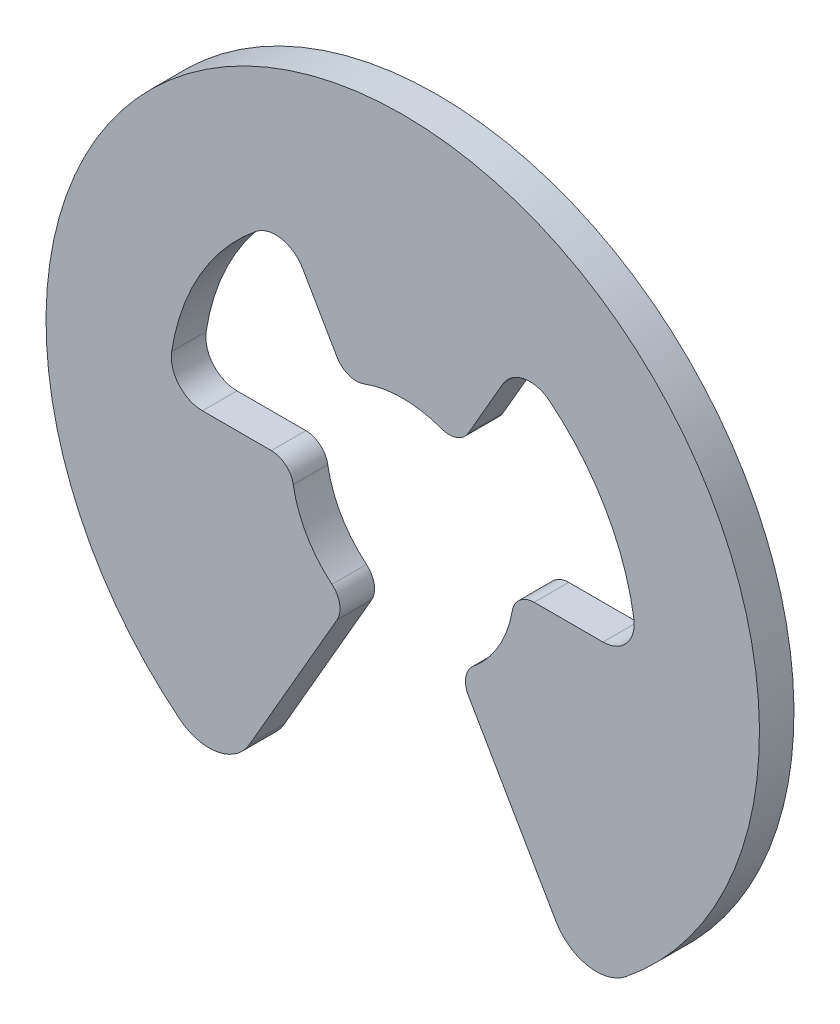
ISO-10303-21;
HEADER;
FILE_DESCRIPTION(('STEP AP214'),'2;1');
FILE_NAME('part.step','',(''),(''),'','','');
FILE_SCHEMA(('AUTOMOTIVE_DESIGN { 1 0 10303 214 1 1 1 1 }'));
ENDSEC;
DATA;
#1=APPLICATION_CONTEXT('core data for automotive mechanical design processes');
#2=APPLICATION_PROTOCOL_DEFINITION('international standard','automotive_design',2000,#1);
#3=PRODUCT_CONTEXT('',#1,'mechanical');
#4=PRODUCT('Part','Part','',(#3));
#5=PRODUCT_RELATED_PRODUCT_CATEGORY('part','',(#4));
#6=PRODUCT_DEFINITION_FORMATION('','',#4);
#7=PRODUCT_DEFINITION_CONTEXT('part definition',#1,'design');
#8=PRODUCT_DEFINITION('design','',#6,#7);
#9=PRODUCT_DEFINITION_SHAPE('','',#8);
#10=(LENGTH_UNIT() NAMED_UNIT(*) SI_UNIT(.MILLI.,.METRE.));
#11=(NAMED_UNIT(*) PLANE_ANGLE_UNIT() SI_UNIT($,.RADIAN.));
#12=(NAMED_UNIT(*) SI_UNIT($,.STERADIAN.) SOLID_ANGLE_UNIT());
#13=UNCERTAINTY_MEASURE_WITH_UNIT(LENGTH_MEASURE(1.E-05),#10,'distance_accuracy_value','');
#14=(GEOMETRIC_REPRESENTATION_CONTEXT(3) GLOBAL_UNCERTAINTY_ASSIGNED_CONTEXT((#13)) GLOBAL_UNIT_ASSIGNED_CONTEXT((#10,
#11,#12)) REPRESENTATION_CONTEXT('',''));
#15=CARTESIAN_POINT('',(0.,0.,0.));
#16=DIRECTION('',(0.,0.,1.));
#17=DIRECTION('',(1.,0.,0.));
#18=AXIS2_PLACEMENT_3D('',#15,#16,#17);
#19=CARTESIAN_POINT('',(2.13787209593711,-2.67039309024686,0.1905));
#20=DIRECTION('',(0.,0.,-1.));
#21=DIRECTION('',(-1.,0.,0.));
#22=AXIS2_PLACEMENT_3D('',#19,#20,#21);
#23=CYLINDRICAL_SURFACE('',#22,0.516254999999999);
#24=DIRECTION('',(0.,0.,-1.));
#25=VECTOR('',#24,1.);
#26=CARTESIAN_POINT('',(1.6907821511064,-2.9285205902469,0.1905));
#27=LINE('',#26,#25);
#28=CARTESIAN_POINT('',(1.6907821511064,-2.9285205902469,0.1905));
#29=VERTEX_POINT('',#28);
#30=CARTESIAN_POINT('',(1.6907821511064,-2.9285205902469,-0.1905));
#31=VERTEX_POINT('',#30);
#32=EDGE_CURVE('E213',#29,#31,#27,.T.);
#33=ORIENTED_EDGE('',*,*,#32,.T.);
#34=CARTESIAN_POINT('',(2.13787209593711,-2.67039309024686,-0.1905));
#35=DIRECTION('',(0.,0.,1.));
#36=DIRECTION('',(1.,0.,0.));
#37=AXIS2_PLACEMENT_3D('',#34,#35,#36);
#38=CIRCLE('',#37,0.516254999999999);
#39=CARTESIAN_POINT('',(2.4605173556358,-3.0734058213348,-0.1905));
#40=VERTEX_POINT('',#39);
#41=EDGE_CURVE('E207',#31,#40,#38,.T.);
#42=ORIENTED_EDGE('',*,*,#41,.T.);
#43=DIRECTION('',(0.,0.,-1.));
#44=VECTOR('',#43,1.);
#45=CARTESIAN_POINT('',(2.4605173556358,-3.0734058213348,0.1905));
#46=LINE('',#45,#44);
#47=CARTESIAN_POINT('',(2.4605173556358,-3.0734058213348,0.1905));
#48=VERTEX_POINT('',#47);
#49=EDGE_CURVE('E11',#48,#40,#46,.T.);
#50=ORIENTED_EDGE('',*,*,#49,.F.);
#51=CARTESIAN_POINT('',(2.13787209593711,-2.67039309024686,0.1905));
#52=DIRECTION('',(0.,0.,1.));
#53=DIRECTION('',(1.,0.,0.));
#54=AXIS2_PLACEMENT_3D('',#51,#52,#53);
#55=CIRCLE('',#54,0.516254999999999);
#56=EDGE_CURVE('E279',#29,#48,#55,.T.);
#57=ORIENTED_EDGE('',*,*,#56,.F.);
#58=EDGE_LOOP('',(#33,#42,#50,#57));
#59=FACE_BOUND('',#58,.T.);
#60=ADVANCED_FACE('F35',(#59),#23,.T.);
#61=CARTESIAN_POINT('',(0.,0.,0.1905));
#62=DIRECTION('',(0.,0.,-1.));
#63=DIRECTION('',(-1.,0.,0.));
#64=AXIS2_PLACEMENT_3D('',#61,#62,#63);
#65=CYLINDRICAL_SURFACE('',#64,3.93699999999997);
#66=ORIENTED_EDGE('',*,*,#49,.T.);
#67=CARTESIAN_POINT('',(0.,0.,-0.1905));
#68=DIRECTION('',(0.,0.,1.));
#69=DIRECTION('',(1.,0.,0.));
#70=AXIS2_PLACEMENT_3D('',#67,#68,#69);
#71=CIRCLE('',#70,3.93699999999997);
#72=CARTESIAN_POINT('',(-2.4605173556358,-3.0734058213348,-0.1905));
#73=VERTEX_POINT('',#72);
#74=EDGE_CURVE('E197',#40,#73,#71,.T.);
#75=ORIENTED_EDGE('',*,*,#74,.T.);
#76=DIRECTION('',(0.,0.,-1.));
#77=VECTOR('',#76,1.);
#78=CARTESIAN_POINT('',(-2.4605173556358,-3.0734058213348,0.1905));
#79=LINE('',#78,#77);
#80=CARTESIAN_POINT('',(-2.4605173556358,-3.0734058213348,0.1905));
#81=VERTEX_POINT('',#80);
#82=EDGE_CURVE('E42',#81,#73,#79,.T.);
#83=ORIENTED_EDGE('',*,*,#82,.F.);
#84=CARTESIAN_POINT('',(0.,0.,0.1905));
#85=DIRECTION('',(0.,0.,1.));
#86=DIRECTION('',(1.,0.,0.));
#87=AXIS2_PLACEMENT_3D('',#84,#85,#86);
#88=CIRCLE('',#87,3.93699999999997);
#89=EDGE_CURVE('E198',#48,#81,#88,.T.);
#90=ORIENTED_EDGE('',*,*,#89,.F.);
#91=EDGE_LOOP('',(#66,#75,#83,#90));
#92=FACE_BOUND('',#91,.T.);
#93=ADVANCED_FACE('F195',(#92),#65,.T.);
#94=CARTESIAN_POINT('',(-2.13787209593711,-2.67039309024686,0.1905));
#95=DIRECTION('',(0.,0.,-1.));
#96=DIRECTION('',(-1.,0.,0.));
#97=AXIS2_PLACEMENT_3D('',#94,#95,#96);
#98=CYLINDRICAL_SURFACE('',#97,0.516254999999999);
#99=ORIENTED_EDGE('',*,*,#82,.T.);
#100=CARTESIAN_POINT('',(-2.13787209593711,-2.67039309024686,-0.1905));
#101=DIRECTION('',(0.,0.,1.));
#102=DIRECTION('',(1.,0.,0.));
#103=AXIS2_PLACEMENT_3D('',#100,#101,#102);
#104=CIRCLE('',#103,0.516254999999999);
#105=CARTESIAN_POINT('',(-1.6907821511064,-2.9285205902469,-0.1905));
#106=VERTEX_POINT('',#105);
#107=EDGE_CURVE('E211',#73,#106,#104,.T.);
#108=ORIENTED_EDGE('',*,*,#107,.T.);
#109=DIRECTION('',(0.,0.,-1.));
#110=VECTOR('',#109,1.);
#111=CARTESIAN_POINT('',(-1.6907821511064,-2.9285205902469,0.1905));
#112=LINE('',#111,#110);
#113=CARTESIAN_POINT('',(-1.6907821511064,-2.9285205902469,0.1905));
#114=VERTEX_POINT('',#113);
#115=EDGE_CURVE('E365',#114,#106,#112,.T.);
#116=ORIENTED_EDGE('',*,*,#115,.F.);
#117=CARTESIAN_POINT('',(-2.13787209593711,-2.67039309024686,0.1905));
#118=DIRECTION('',(0.,0.,1.));
#119=DIRECTION('',(1.,0.,0.));
#120=AXIS2_PLACEMENT_3D('',#117,#118,#119);
#121=CIRCLE('',#120,0.516254999999999);
#122=EDGE_CURVE('E282',#81,#114,#121,.T.);
#123=ORIENTED_EDGE('',*,*,#122,.F.);
#124=EDGE_LOOP('',(#99,#108,#116,#123));
#125=FACE_BOUND('',#124,.T.);
#126=ADVANCED_FACE('F368',(#125),#98,.T.);
#127=CARTESIAN_POINT('',(-1.6907821511064,-2.9285205902469,0.1905));
#128=DIRECTION('',(-0.866025403784437,0.500000000000002,0.));
#129=DIRECTION('',(-0.500000000000002,-0.866025403784437,0.));
#130=AXIS2_PLACEMENT_3D('',#127,#128,#129);
#131=PLANE('',#130);
#132=ORIENTED_EDGE('',*,*,#115,.T.);
#133=DIRECTION('',(0.500000000000002,0.866025403784437,0.));
#134=VECTOR('',#133,1.);
#135=CARTESIAN_POINT('',(-1.6907821511064,-2.9285205902469,-0.1905));
#136=LINE('',#135,#134);
#137=CARTESIAN_POINT('',(-0.72504515781777,-1.2558150511222,-0.1905));
#138=VERTEX_POINT('',#137);
#139=EDGE_CURVE('E217',#106,#138,#136,.T.);
#140=ORIENTED_EDGE('',*,*,#139,.T.);
#141=DIRECTION('',(0.,0.,-1.));
#142=VECTOR('',#141,1.);
#143=CARTESIAN_POINT('',(-0.72504515781777,-1.2558150511222,0.1905));
#144=LINE('',#143,#142);
#145=CARTESIAN_POINT('',(-0.72504515781777,-1.2558150511222,0.1905));
#146=VERTEX_POINT('',#145);
#147=EDGE_CURVE('E363',#146,#138,#144,.T.);
#148=ORIENTED_EDGE('',*,*,#147,.F.);
#149=DIRECTION('',(0.500000000000002,0.866025403784437,0.));
#150=VECTOR('',#149,1.);
#151=CARTESIAN_POINT('',(-1.6907821511064,-2.9285205902469,0.1905));
#152=LINE('',#151,#150);
#153=EDGE_CURVE('E284',#114,#146,#152,.T.);
#154=ORIENTED_EDGE('',*,*,#153,.F.);
#155=EDGE_LOOP('',(#132,#140,#148,#154));
#156=FACE_BOUND('',#155,.T.);
#157=ADVANCED_FACE('F376',(#156),#131,.F.);
#158=CARTESIAN_POINT('',(-0.937316644539424,-1.1332600511222,0.1905));
#159=DIRECTION('',(0.,0.,-1.));
#160=DIRECTION('',(-1.,0.,0.));
#161=AXIS2_PLACEMENT_3D('',#158,#159,#160);
#162=CYLINDRICAL_SURFACE('',#161,0.245110000000045);
#163=ORIENTED_EDGE('',*,*,#147,.T.);
#164=CARTESIAN_POINT('',(-0.937316644539424,-1.1332600511222,-0.1905));
#165=DIRECTION('',(0.,0.,1.));
#166=DIRECTION('',(1.,0.,0.));
#167=AXIS2_PLACEMENT_3D('',#164,#165,#166);
#168=CIRCLE('',#167,0.245110000000045);
#169=CARTESIAN_POINT('',(-0.78109720378281,-0.94438337593515,-0.1905));
#170=VERTEX_POINT('',#169);
#171=EDGE_CURVE('E220',#138,#170,#168,.T.);
#172=ORIENTED_EDGE('',*,*,#171,.T.);
#173=DIRECTION('',(0.,0.,-1.));
#174=VECTOR('',#173,1.);
#175=CARTESIAN_POINT('',(-0.78109720378281,-0.94438337593515,0.1905));
#176=LINE('',#175,#174);
#177=CARTESIAN_POINT('',(-0.78109720378281,-0.94438337593515,0.1905));
#178=VERTEX_POINT('',#177);
#179=EDGE_CURVE('E361',#178,#170,#176,.T.);
#180=ORIENTED_EDGE('',*,*,#179,.F.);
#181=CARTESIAN_POINT('',(-0.937316644539424,-1.1332600511222,0.1905));
#182=DIRECTION('',(0.,0.,1.));
#183=DIRECTION('',(1.,0.,0.));
#184=AXIS2_PLACEMENT_3D('',#181,#182,#183);
#185=CIRCLE('',#184,0.245110000000045);
#186=EDGE_CURVE('E286',#146,#178,#185,.T.);
#187=ORIENTED_EDGE('',*,*,#186,.F.);
#188=EDGE_LOOP('',(#163,#172,#180,#187));
#189=FACE_BOUND('',#188,.T.);
#190=ADVANCED_FACE('F379',(#189),#162,.T.);
#191=CARTESIAN_POINT('',(0.,0.,0.1905));
#192=DIRECTION('',(0.,0.,-1.));
#193=DIRECTION('',(-1.,0.,0.));
#194=AXIS2_PLACEMENT_3D('',#191,#192,#193);
#195=CYLINDRICAL_SURFACE('',#194,1.22555000000003);
#196=ORIENTED_EDGE('',*,*,#179,.T.);
#197=CARTESIAN_POINT('',(0.,0.,-0.1905));
#198=DIRECTION('',(0.,0.,-1.));
#199=DIRECTION('',(-1.,0.,0.));
#200=AXIS2_PLACEMENT_3D('',#197,#198,#199);
#201=CIRCLE('',#200,1.22555000000003);
#202=CARTESIAN_POINT('',(-1.20840859636299,-0.204258333333328,-0.1905));
#203=VERTEX_POINT('',#202);
#204=EDGE_CURVE('E223',#170,#203,#201,.T.);
#205=ORIENTED_EDGE('',*,*,#204,.T.);
#206=DIRECTION('',(0.,0.,-1.));
#207=VECTOR('',#206,1.);
#208=CARTESIAN_POINT('',(-1.20840859636299,-0.204258333333328,0.1905));
#209=LINE('',#208,#207);
#210=CARTESIAN_POINT('',(-1.20840859636299,-0.204258333333328,0.1905));
#211=VERTEX_POINT('',#210);
#212=EDGE_CURVE('E359',#211,#203,#209,.T.);
#213=ORIENTED_EDGE('',*,*,#212,.F.);
#214=CARTESIAN_POINT('',(0.,0.,0.1905));
#215=DIRECTION('',(0.,0.,-1.));
#216=DIRECTION('',(-1.,0.,0.));
#217=AXIS2_PLACEMENT_3D('',#214,#215,#216);
#218=CIRCLE('',#217,1.22555000000003);
#219=EDGE_CURVE('E288',#178,#211,#218,.T.);
#220=ORIENTED_EDGE('',*,*,#219,.F.);
#221=EDGE_LOOP('',(#196,#205,#213,#220));
#222=FACE_BOUND('',#221,.T.);
#223=ADVANCED_FACE('F384',(#222),#195,.F.);
#224=CARTESIAN_POINT('',(-1.45009031563546,-0.245109999999846,0.1905));
#225=DIRECTION('',(0.,0.,-1.));
#226=DIRECTION('',(-1.,0.,0.));
#227=AXIS2_PLACEMENT_3D('',#224,#225,#226);
#228=CYLINDRICAL_SURFACE('',#227,0.245109999999846);
#229=ORIENTED_EDGE('',*,*,#212,.T.);
#230=CARTESIAN_POINT('',(-1.45009031563546,-0.245109999999846,-0.1905));
#231=DIRECTION('',(0.,0.,1.));
#232=DIRECTION('',(1.,0.,0.));
#233=AXIS2_PLACEMENT_3D('',#230,#231,#232);
#234=CIRCLE('',#233,0.245109999999846);
#235=CARTESIAN_POINT('',(-1.4500903156355,0.,-0.1905));
#236=VERTEX_POINT('',#235);
#237=EDGE_CURVE('E226',#203,#236,#234,.T.);
#238=ORIENTED_EDGE('',*,*,#237,.T.);
#239=DIRECTION('',(0.,0.,-1.));
#240=VECTOR('',#239,1.);
#241=CARTESIAN_POINT('',(-1.4500903156355,0.,0.1905));
#242=LINE('',#241,#240);
#243=CARTESIAN_POINT('',(-1.4500903156355,0.,0.1905));
#244=VERTEX_POINT('',#243);
#245=EDGE_CURVE('E357',#244,#236,#242,.T.);
#246=ORIENTED_EDGE('',*,*,#245,.F.);
#247=CARTESIAN_POINT('',(-1.45009031563546,-0.245109999999846,0.1905));
#248=DIRECTION('',(0.,0.,1.));
#249=DIRECTION('',(1.,0.,0.));
#250=AXIS2_PLACEMENT_3D('',#247,#248,#249);
#251=CIRCLE('',#250,0.245109999999846);
#252=EDGE_CURVE('E290',#211,#244,#251,.T.);
#253=ORIENTED_EDGE('',*,*,#252,.F.);
#254=EDGE_LOOP('',(#229,#238,#246,#253));
#255=FACE_BOUND('',#254,.T.);
#256=ADVANCED_FACE('F390',(#255),#228,.T.);
#257=CARTESIAN_POINT('',(-1.4500903156355,0.,0.1905));
#258=DIRECTION('',(0.,-1.,0.));
#259=DIRECTION('',(0.,0.,-1.));
#260=AXIS2_PLACEMENT_3D('',#257,#258,#259);
#261=PLANE('',#260);
#262=ORIENTED_EDGE('',*,*,#245,.T.);
#263=DIRECTION('',(-1.,0.,0.));
#264=VECTOR('',#263,1.);
#265=CARTESIAN_POINT('',(-1.4500903156355,0.,-0.1905));
#266=LINE('',#265,#264);
#267=CARTESIAN_POINT('',(-2.2104718482996,0.,-0.1905));
#268=VERTEX_POINT('',#267);
#269=EDGE_CURVE('E229',#236,#268,#266,.T.);
#270=ORIENTED_EDGE('',*,*,#269,.T.);
#271=DIRECTION('',(0.,0.,-1.));
#272=VECTOR('',#271,1.);
#273=CARTESIAN_POINT('',(-2.2104718482996,0.,0.1905));
#274=LINE('',#273,#272);
#275=CARTESIAN_POINT('',(-2.2104718482996,0.,0.1905));
#276=VERTEX_POINT('',#275);
#277=EDGE_CURVE('E355',#276,#268,#274,.T.);
#278=ORIENTED_EDGE('',*,*,#277,.F.);
#279=DIRECTION('',(-1.,0.,0.));
#280=VECTOR('',#279,1.);
#281=CARTESIAN_POINT('',(-1.4500903156355,0.,0.1905));
#282=LINE('',#281,#280);
#283=EDGE_CURVE('E292',#244,#276,#282,.T.);
#284=ORIENTED_EDGE('',*,*,#283,.F.);
#285=EDGE_LOOP('',(#262,#270,#278,#284));
#286=FACE_BOUND('',#285,.T.);
#287=ADVANCED_FACE('F394',(#286),#261,.F.);
#288=CARTESIAN_POINT('',(-2.21047184829961,0.344169999999997,0.1905));
#289=DIRECTION('',(0.,0.,-1.));
#290=DIRECTION('',(-1.,0.,0.));
#291=AXIS2_PLACEMENT_3D('',#288,#289,#290);
#292=CYLINDRICAL_SURFACE('',#291,0.344169999999997);
#293=ORIENTED_EDGE('',*,*,#277,.T.);
#294=CARTESIAN_POINT('',(-2.21047184829961,0.344169999999997,-0.1905));
#295=DIRECTION('',(0.,0.,-1.));
#296=DIRECTION('',(-1.,0.,0.));
#297=AXIS2_PLACEMENT_3D('',#294,#295,#296);
#298=CIRCLE('',#297,0.344169999999997);
#299=CARTESIAN_POINT('',(-2.5505444403457,0.39711923076923,-0.1905));
#300=VERTEX_POINT('',#299);
#301=EDGE_CURVE('E232',#268,#300,#298,.T.);
#302=ORIENTED_EDGE('',*,*,#301,.T.);
#303=DIRECTION('',(0.,0.,-1.));
#304=VECTOR('',#303,1.);
#305=CARTESIAN_POINT('',(-2.5505444403457,0.39711923076923,0.1905));
#306=LINE('',#305,#304);
#307=CARTESIAN_POINT('',(-2.5505444403457,0.39711923076923,0.1905));
#308=VERTEX_POINT('',#307);
#309=EDGE_CURVE('E353',#308,#300,#306,.T.);
#310=ORIENTED_EDGE('',*,*,#309,.F.);
#311=CARTESIAN_POINT('',(-2.21047184829961,0.344169999999997,0.1905));
#312=DIRECTION('',(0.,0.,-1.));
#313=DIRECTION('',(-1.,0.,0.));
#314=AXIS2_PLACEMENT_3D('',#311,#312,#313);
#315=CIRCLE('',#314,0.344169999999997);
#316=EDGE_CURVE('E294',#276,#308,#315,.T.);
#317=ORIENTED_EDGE('',*,*,#316,.F.);
#318=EDGE_LOOP('',(#293,#302,#310,#317));
#319=FACE_BOUND('',#318,.T.);
#320=ADVANCED_FACE('F399',(#319),#292,.F.);
#321=CARTESIAN_POINT('',(0.,0.,0.1905));
#322=DIRECTION('',(0.,0.,-1.));
#323=DIRECTION('',(-1.,0.,0.));
#324=AXIS2_PLACEMENT_3D('',#321,#322,#323);
#325=CYLINDRICAL_SURFACE('',#324,2.581275);
#326=ORIENTED_EDGE('',*,*,#309,.T.);
#327=CARTESIAN_POINT('',(0.,0.,-0.1905));
#328=DIRECTION('',(0.,0.,-1.));
#329=DIRECTION('',(-1.,0.,0.));
#330=AXIS2_PLACEMENT_3D('',#327,#328,#329);
#331=CIRCLE('',#330,2.581275);
#332=CARTESIAN_POINT('',(-1.61918752550471,2.01027669311342,-0.1905));
#333=VERTEX_POINT('',#332);
#334=EDGE_CURVE('E235',#300,#333,#331,.T.);
#335=ORIENTED_EDGE('',*,*,#334,.T.);
#336=DIRECTION('',(0.,0.,-1.));
#337=VECTOR('',#336,1.);
#338=CARTESIAN_POINT('',(-1.61918752550471,2.01027669311342,0.1905));
#339=LINE('',#338,#337);
#340=CARTESIAN_POINT('',(-1.61918752550471,2.01027669311342,0.1905));
#341=VERTEX_POINT('',#340);
#342=EDGE_CURVE('E351',#341,#333,#339,.T.);
#343=ORIENTED_EDGE('',*,*,#342,.F.);
#344=CARTESIAN_POINT('',(0.,0.,0.1905));
#345=DIRECTION('',(0.,0.,-1.));
#346=DIRECTION('',(-1.,0.,0.));
#347=AXIS2_PLACEMENT_3D('',#344,#345,#346);
#348=CIRCLE('',#347,2.581275);
#349=EDGE_CURVE('E296',#308,#341,#348,.T.);
#350=ORIENTED_EDGE('',*,*,#349,.F.);
#351=EDGE_LOOP('',(#326,#335,#343,#350));
#352=FACE_BOUND('',#351,.T.);
#353=ADVANCED_FACE('F405',(#352),#325,.F.);
#354=CARTESIAN_POINT('',(-1.4032958873703,1.74223977497771,0.1905));
#355=DIRECTION('',(0.,0.,-1.));
#356=DIRECTION('',(-1.,0.,0.));
#357=AXIS2_PLACEMENT_3D('',#354,#355,#356);
#358=CYLINDRICAL_SURFACE('',#357,0.344170000000049);
#359=ORIENTED_EDGE('',*,*,#342,.T.);
#360=CARTESIAN_POINT('',(-1.4032958873703,1.74223977497771,-0.1905));
#361=DIRECTION('',(0.,0.,-1.));
#362=DIRECTION('',(-1.,0.,0.));
#363=AXIS2_PLACEMENT_3D('',#360,#361,#362);
#364=CIRCLE('',#363,0.344170000000049);
#365=CARTESIAN_POINT('',(-1.1052359241498,1.9143247749778,-0.1905));
#366=VERTEX_POINT('',#365);
#367=EDGE_CURVE('E238',#333,#366,#364,.T.);
#368=ORIENTED_EDGE('',*,*,#367,.T.);
#369=DIRECTION('',(0.,0.,-1.));
#370=VECTOR('',#369,1.);
#371=CARTESIAN_POINT('',(-1.1052359241498,1.9143247749778,0.1905));
#372=LINE('',#371,#370);
#373=CARTESIAN_POINT('',(-1.1052359241498,1.9143247749778,0.1905));
#374=VERTEX_POINT('',#373);
#375=EDGE_CURVE('E349',#374,#366,#372,.T.);
#376=ORIENTED_EDGE('',*,*,#375,.F.);
#377=CARTESIAN_POINT('',(-1.4032958873703,1.74223977497771,0.1905));
#378=DIRECTION('',(0.,0.,-1.));
#379=DIRECTION('',(-1.,0.,0.));
#380=AXIS2_PLACEMENT_3D('',#377,#378,#379);
#381=CIRCLE('',#380,0.344170000000049);
#382=EDGE_CURVE('E298',#341,#374,#381,.T.);
#383=ORIENTED_EDGE('',*,*,#382,.F.);
#384=EDGE_LOOP('',(#359,#368,#376,#383));
#385=FACE_BOUND('',#384,.T.);
#386=ADVANCED_FACE('F409',(#385),#358,.F.);
#387=CARTESIAN_POINT('',(-1.1052359241498,1.9143247749778,0.1905));
#388=DIRECTION('',(0.866025403784431,0.500000000000013,0.));
#389=DIRECTION('',(-0.500000000000013,0.866025403784431,0.));
#390=AXIS2_PLACEMENT_3D('',#387,#388,#389);
#391=PLANE('',#390);
#392=ORIENTED_EDGE('',*,*,#375,.T.);
#393=DIRECTION('',(0.500000000000013,-0.866025403784431,0.));
#394=VECTOR('',#393,1.);
#395=CARTESIAN_POINT('',(-1.1052359241498,1.9143247749778,-0.1905));
#396=LINE('',#395,#394);
#397=CARTESIAN_POINT('',(-0.72504515781777,1.2558150511222,-0.1905));
#398=VERTEX_POINT('',#397);
#399=EDGE_CURVE('E241',#366,#398,#396,.T.);
#400=ORIENTED_EDGE('',*,*,#399,.T.);
#401=DIRECTION('',(0.,0.,-1.));
#402=VECTOR('',#401,1.);
#403=CARTESIAN_POINT('',(-0.72504515781777,1.2558150511222,0.1905));
#404=LINE('',#403,#402);
#405=CARTESIAN_POINT('',(-0.72504515781777,1.2558150511222,0.1905));
#406=VERTEX_POINT('',#405);
#407=EDGE_CURVE('E347',#406,#398,#404,.T.);
#408=ORIENTED_EDGE('',*,*,#407,.F.);
#409=DIRECTION('',(0.500000000000013,-0.866025403784431,0.));
#410=VECTOR('',#409,1.);
#411=CARTESIAN_POINT('',(-1.1052359241498,1.9143247749778,0.1905));
#412=LINE('',#411,#410);
#413=EDGE_CURVE('E300',#374,#406,#412,.T.);
#414=ORIENTED_EDGE('',*,*,#413,.F.);
#415=EDGE_LOOP('',(#392,#400,#408,#414));
#416=FACE_BOUND('',#415,.T.);
#417=ADVANCED_FACE('F414',(#416),#391,.F.);
#418=CARTESIAN_POINT('',(-0.512773671096169,1.37837005112219,0.1905));
#419=DIRECTION('',(0.,0.,-1.));
#420=DIRECTION('',(-1.,0.,0.));
#421=AXIS2_PLACEMENT_3D('',#418,#419,#420);
#422=CYLINDRICAL_SURFACE('',#421,0.24510999999999);
#423=ORIENTED_EDGE('',*,*,#407,.T.);
#424=CARTESIAN_POINT('',(-0.512773671096169,1.37837005112219,-0.1905));
#425=DIRECTION('',(0.,0.,1.));
#426=DIRECTION('',(1.,0.,0.));
#427=AXIS2_PLACEMENT_3D('',#424,#425,#426);
#428=CIRCLE('',#427,0.24510999999999);
#429=CARTESIAN_POINT('',(-0.42731139258014,1.1486417092685,-0.1905));
#430=VERTEX_POINT('',#429);
#431=EDGE_CURVE('E244',#398,#430,#428,.T.);
#432=ORIENTED_EDGE('',*,*,#431,.T.);
#433=DIRECTION('',(0.,0.,-1.));
#434=VECTOR('',#433,1.);
#435=CARTESIAN_POINT('',(-0.42731139258014,1.1486417092685,0.1905));
#436=LINE('',#435,#434);
#437=CARTESIAN_POINT('',(-0.42731139258014,1.1486417092685,0.1905));
#438=VERTEX_POINT('',#437);
#439=EDGE_CURVE('E345',#438,#430,#436,.T.);
#440=ORIENTED_EDGE('',*,*,#439,.F.);
#441=CARTESIAN_POINT('',(-0.512773671096169,1.37837005112219,0.1905));
#442=DIRECTION('',(0.,0.,1.));
#443=DIRECTION('',(1.,0.,0.));
#444=AXIS2_PLACEMENT_3D('',#441,#442,#443);
#445=CIRCLE('',#444,0.24510999999999);
#446=EDGE_CURVE('E302',#406,#438,#445,.T.);
#447=ORIENTED_EDGE('',*,*,#446,.F.);
#448=EDGE_LOOP('',(#423,#432,#440,#447));
#449=FACE_BOUND('',#448,.T.);
#450=ADVANCED_FACE('F420',(#449),#422,.T.);
#451=CARTESIAN_POINT('',(0.,0.,0.1905));
#452=DIRECTION('',(0.,0.,-1.));
#453=DIRECTION('',(-1.,0.,0.));
#454=AXIS2_PLACEMENT_3D('',#451,#452,#453);
#455=CYLINDRICAL_SURFACE('',#454,1.22554999999999);
#456=ORIENTED_EDGE('',*,*,#439,.T.);
#457=CARTESIAN_POINT('',(0.,0.,-0.1905));
#458=DIRECTION('',(0.,0.,-1.));
#459=DIRECTION('',(-1.,0.,0.));
#460=AXIS2_PLACEMENT_3D('',#457,#458,#459);
#461=CIRCLE('',#460,1.22554999999999);
#462=CARTESIAN_POINT('',(0.42731139258014,1.1486417092685,-0.1905));
#463=VERTEX_POINT('',#462);
#464=EDGE_CURVE('E247',#430,#463,#461,.T.);
#465=ORIENTED_EDGE('',*,*,#464,.T.);
#466=DIRECTION('',(0.,0.,-1.));
#467=VECTOR('',#466,1.);
#468=CARTESIAN_POINT('',(0.42731139258014,1.1486417092685,0.1905));
#469=LINE('',#468,#467);
#470=CARTESIAN_POINT('',(0.42731139258014,1.1486417092685,0.1905));
#471=VERTEX_POINT('',#470);
#472=EDGE_CURVE('E343',#471,#463,#469,.T.);
#473=ORIENTED_EDGE('',*,*,#472,.F.);
#474=CARTESIAN_POINT('',(0.,0.,0.1905));
#475=DIRECTION('',(0.,0.,-1.));
#476=DIRECTION('',(-1.,0.,0.));
#477=AXIS2_PLACEMENT_3D('',#474,#475,#476);
#478=CIRCLE('',#477,1.22554999999999);
#479=EDGE_CURVE('E304',#438,#471,#478,.T.);
#480=ORIENTED_EDGE('',*,*,#479,.F.);
#481=EDGE_LOOP('',(#456,#465,#473,#480));
#482=FACE_BOUND('',#481,.T.);
#483=ADVANCED_FACE('F424',(#482),#455,.F.);
#484=CARTESIAN_POINT('',(0.512773671096169,1.37837005112219,0.1905));
#485=DIRECTION('',(0.,0.,-1.));
#486=DIRECTION('',(-1.,0.,0.));
#487=AXIS2_PLACEMENT_3D('',#484,#485,#486);
#488=CYLINDRICAL_SURFACE('',#487,0.24510999999999);
#489=ORIENTED_EDGE('',*,*,#472,.T.);
#490=CARTESIAN_POINT('',(0.512773671096169,1.37837005112219,-0.1905));
#491=DIRECTION('',(0.,0.,1.));
#492=DIRECTION('',(1.,0.,0.));
#493=AXIS2_PLACEMENT_3D('',#490,#491,#492);
#494=CIRCLE('',#493,0.24510999999999);
#495=CARTESIAN_POINT('',(0.72504515781777,1.2558150511222,-0.1905));
#496=VERTEX_POINT('',#495);
#497=EDGE_CURVE('E250',#463,#496,#494,.T.);
#498=ORIENTED_EDGE('',*,*,#497,.T.);
#499=DIRECTION('',(0.,0.,-1.));
#500=VECTOR('',#499,1.);
#501=CARTESIAN_POINT('',(0.72504515781777,1.2558150511222,0.1905));
#502=LINE('',#501,#500);
#503=CARTESIAN_POINT('',(0.72504515781777,1.2558150511222,0.1905));
#504=VERTEX_POINT('',#503);
#505=EDGE_CURVE('E341',#504,#496,#502,.T.);
#506=ORIENTED_EDGE('',*,*,#505,.F.);
#507=CARTESIAN_POINT('',(0.512773671096169,1.37837005112219,0.1905));
#508=DIRECTION('',(0.,0.,1.));
#509=DIRECTION('',(1.,0.,0.));
#510=AXIS2_PLACEMENT_3D('',#507,#508,#509);
#511=CIRCLE('',#510,0.24510999999999);
#512=EDGE_CURVE('E306',#471,#504,#511,.T.);
#513=ORIENTED_EDGE('',*,*,#512,.F.);
#514=EDGE_LOOP('',(#489,#498,#506,#513));
#515=FACE_BOUND('',#514,.T.);
#516=ADVANCED_FACE('F429',(#515),#488,.T.);
#517=CARTESIAN_POINT('',(0.72504515781777,1.2558150511222,0.1905));
#518=DIRECTION('',(-0.866025403784431,0.500000000000013,0.));
#519=DIRECTION('',(-0.500000000000013,-0.866025403784431,0.));
#520=AXIS2_PLACEMENT_3D('',#517,#518,#519);
#521=PLANE('',#520);
#522=ORIENTED_EDGE('',*,*,#505,.T.);
#523=DIRECTION('',(0.500000000000013,0.866025403784431,0.));
#524=VECTOR('',#523,1.);
#525=CARTESIAN_POINT('',(0.72504515781777,1.2558150511222,-0.1905));
#526=LINE('',#525,#524);
#527=CARTESIAN_POINT('',(1.1052359241498,1.9143247749778,-0.1905));
#528=VERTEX_POINT('',#527);
#529=EDGE_CURVE('E253',#496,#528,#526,.T.);
#530=ORIENTED_EDGE('',*,*,#529,.T.);
#531=DIRECTION('',(0.,0.,-1.));
#532=VECTOR('',#531,1.);
#533=CARTESIAN_POINT('',(1.1052359241498,1.9143247749778,0.1905));
#534=LINE('',#533,#532);
#535=CARTESIAN_POINT('',(1.1052359241498,1.9143247749778,0.1905));
#536=VERTEX_POINT('',#535);
#537=EDGE_CURVE('E339',#536,#528,#534,.T.);
#538=ORIENTED_EDGE('',*,*,#537,.F.);
#539=DIRECTION('',(0.500000000000013,0.866025403784431,0.));
#540=VECTOR('',#539,1.);
#541=CARTESIAN_POINT('',(0.72504515781777,1.2558150511222,0.1905));
#542=LINE('',#541,#540);
#543=EDGE_CURVE('E308',#504,#536,#542,.T.);
#544=ORIENTED_EDGE('',*,*,#543,.F.);
#545=EDGE_LOOP('',(#522,#530,#538,#544));
#546=FACE_BOUND('',#545,.T.);
#547=ADVANCED_FACE('F435',(#546),#521,.F.);
#548=CARTESIAN_POINT('',(1.40329588737031,1.74223977497769,0.1905));
#549=DIRECTION('',(0.,0.,-1.));
#550=DIRECTION('',(-1.,0.,0.));
#551=AXIS2_PLACEMENT_3D('',#548,#549,#550);
#552=CYLINDRICAL_SURFACE('',#551,0.344170000000072);
#553=ORIENTED_EDGE('',*,*,#537,.T.);
#554=CARTESIAN_POINT('',(1.40329588737031,1.74223977497769,-0.1905));
#555=DIRECTION('',(0.,0.,-1.));
#556=DIRECTION('',(-1.,0.,0.));
#557=AXIS2_PLACEMENT_3D('',#554,#555,#556);
#558=CIRCLE('',#557,0.344170000000072);
#559=CARTESIAN_POINT('',(1.6191875776257,2.0102766511323,-0.1905));
#560=VERTEX_POINT('',#559);
#561=EDGE_CURVE('E256',#528,#560,#558,.T.);
#562=ORIENTED_EDGE('',*,*,#561,.T.);
#563=DIRECTION('',(0.,0.,-1.));
#564=VECTOR('',#563,1.);
#565=CARTESIAN_POINT('',(1.6191875776257,2.0102766511323,0.1905));
#566=LINE('',#565,#564);
#567=CARTESIAN_POINT('',(1.6191875776257,2.0102766511323,0.1905));
#568=VERTEX_POINT('',#567);
#569=EDGE_CURVE('E337',#568,#560,#566,.T.);
#570=ORIENTED_EDGE('',*,*,#569,.F.);
#571=CARTESIAN_POINT('',(1.40329588737031,1.74223977497769,0.1905));
#572=DIRECTION('',(0.,0.,-1.));
#573=DIRECTION('',(-1.,0.,0.));
#574=AXIS2_PLACEMENT_3D('',#571,#572,#573);
#575=CIRCLE('',#574,0.344170000000072);
#576=EDGE_CURVE('E310',#536,#568,#575,.T.);
#577=ORIENTED_EDGE('',*,*,#576,.F.);
#578=EDGE_LOOP('',(#553,#562,#570,#577));
#579=FACE_BOUND('',#578,.T.);
#580=ADVANCED_FACE('F439',(#579),#552,.F.);
#581=CARTESIAN_POINT('',(0.,0.,0.1905));
#582=DIRECTION('',(0.,0.,-1.));
#583=DIRECTION('',(-1.,0.,0.));
#584=AXIS2_PLACEMENT_3D('',#581,#582,#583);
#585=CYLINDRICAL_SURFACE('',#584,2.58127499999998);
#586=ORIENTED_EDGE('',*,*,#569,.T.);
#587=CARTESIAN_POINT('',(0.,0.,-0.1905));
#588=DIRECTION('',(0.,0.,-1.));
#589=DIRECTION('',(-1.,0.,0.));
#590=AXIS2_PLACEMENT_3D('',#587,#588,#589);
#591=CIRCLE('',#590,2.58127499999998);
#592=CARTESIAN_POINT('',(2.55054443306702,0.397119277517173,-0.1905));
#593=VERTEX_POINT('',#592);
#594=EDGE_CURVE('E259',#560,#593,#591,.T.);
#595=ORIENTED_EDGE('',*,*,#594,.T.);
#596=DIRECTION('',(0.,0.,-1.));
#597=VECTOR('',#596,1.);
#598=CARTESIAN_POINT('',(2.55054443306702,0.397119277517173,0.1905));
#599=LINE('',#598,#597);
#600=CARTESIAN_POINT('',(2.55054443306702,0.397119277517173,0.1905));
#601=VERTEX_POINT('',#600);
#602=EDGE_CURVE('E335',#601,#593,#599,.T.);
#603=ORIENTED_EDGE('',*,*,#602,.F.);
#604=CARTESIAN_POINT('',(0.,0.,0.1905));
#605=DIRECTION('',(0.,0.,-1.));
#606=DIRECTION('',(-1.,0.,0.));
#607=AXIS2_PLACEMENT_3D('',#604,#605,#606);
#608=CIRCLE('',#607,2.58127499999998);
#609=EDGE_CURVE('E312',#568,#601,#608,.T.);
#610=ORIENTED_EDGE('',*,*,#609,.F.);
#611=EDGE_LOOP('',(#586,#595,#603,#610));
#612=FACE_BOUND('',#611,.T.);
#613=ADVANCED_FACE('F444',(#612),#585,.F.);
#614=CARTESIAN_POINT('',(2.21047184829965,0.344169999999923,0.1905));
#615=DIRECTION('',(0.,0.,-1.));
#616=DIRECTION('',(-1.,0.,0.));
#617=AXIS2_PLACEMENT_3D('',#614,#615,#616);
#618=CYLINDRICAL_SURFACE('',#617,0.344169999999923);
#619=ORIENTED_EDGE('',*,*,#602,.T.);
#620=CARTESIAN_POINT('',(2.21047184829965,0.344169999999923,-0.1905));
#621=DIRECTION('',(0.,0.,-1.));
#622=DIRECTION('',(-1.,0.,0.));
#623=AXIS2_PLACEMENT_3D('',#620,#621,#622);
#624=CIRCLE('',#623,0.344169999999923);
#625=CARTESIAN_POINT('',(2.2104718482996,0.,-0.1905));
#626=VERTEX_POINT('',#625);
#627=EDGE_CURVE('E262',#593,#626,#624,.T.);
#628=ORIENTED_EDGE('',*,*,#627,.T.);
#629=DIRECTION('',(0.,0.,-1.));
#630=VECTOR('',#629,1.);
#631=CARTESIAN_POINT('',(2.2104718482996,0.,0.1905));
#632=LINE('',#631,#630);
#633=CARTESIAN_POINT('',(2.2104718482996,0.,0.1905));
#634=VERTEX_POINT('',#633);
#635=EDGE_CURVE('E333',#634,#626,#632,.T.);
#636=ORIENTED_EDGE('',*,*,#635,.F.);
#637=CARTESIAN_POINT('',(2.21047184829965,0.344169999999923,0.1905));
#638=DIRECTION('',(0.,0.,-1.));
#639=DIRECTION('',(-1.,0.,0.));
#640=AXIS2_PLACEMENT_3D('',#637,#638,#639);
#641=CIRCLE('',#640,0.344169999999923);
#642=EDGE_CURVE('E314',#601,#634,#641,.T.);
#643=ORIENTED_EDGE('',*,*,#642,.F.);
#644=EDGE_LOOP('',(#619,#628,#636,#643));
#645=FACE_BOUND('',#644,.T.);
#646=ADVANCED_FACE('F450',(#645),#618,.F.);
#647=CARTESIAN_POINT('',(2.2104718482996,0.,0.1905));
#648=DIRECTION('',(0.,-1.,0.));
#649=DIRECTION('',(0.,0.,-1.));
#650=AXIS2_PLACEMENT_3D('',#647,#648,#649);
#651=PLANE('',#650);
#652=ORIENTED_EDGE('',*,*,#635,.T.);
#653=DIRECTION('',(-1.,0.,0.));
#654=VECTOR('',#653,1.);
#655=CARTESIAN_POINT('',(2.2104718482996,0.,-0.1905));
#656=LINE('',#655,#654);
#657=CARTESIAN_POINT('',(1.4500903156355,0.,-0.1905));
#658=VERTEX_POINT('',#657);
#659=EDGE_CURVE('E265',#626,#658,#656,.T.);
#660=ORIENTED_EDGE('',*,*,#659,.T.);
#661=DIRECTION('',(0.,0.,-1.));
#662=VECTOR('',#661,1.);
#663=CARTESIAN_POINT('',(1.4500903156355,0.,0.1905));
#664=LINE('',#663,#662);
#665=CARTESIAN_POINT('',(1.4500903156355,0.,0.1905));
#666=VERTEX_POINT('',#665);
#667=EDGE_CURVE('E331',#666,#658,#664,.T.);
#668=ORIENTED_EDGE('',*,*,#667,.F.);
#669=DIRECTION('',(-1.,0.,0.));
#670=VECTOR('',#669,1.);
#671=CARTESIAN_POINT('',(2.2104718482996,0.,0.1905));
#672=LINE('',#671,#670);
#673=EDGE_CURVE('E316',#634,#666,#672,.T.);
#674=ORIENTED_EDGE('',*,*,#673,.F.);
#675=EDGE_LOOP('',(#652,#660,#668,#674));
#676=FACE_BOUND('',#675,.T.);
#677=ADVANCED_FACE('F454',(#676),#651,.F.);
#678=CARTESIAN_POINT('',(1.45009031563546,-0.245109999999847,0.1905));
#679=DIRECTION('',(0.,0.,-1.));
#680=DIRECTION('',(-1.,0.,0.));
#681=AXIS2_PLACEMENT_3D('',#678,#679,#680);
#682=CYLINDRICAL_SURFACE('',#681,0.245109999999846);
#683=ORIENTED_EDGE('',*,*,#667,.T.);
#684=CARTESIAN_POINT('',(1.45009031563546,-0.245109999999847,-0.1905));
#685=DIRECTION('',(0.,0.,1.));
#686=DIRECTION('',(1.,0.,0.));
#687=AXIS2_PLACEMENT_3D('',#684,#685,#686);
#688=CIRCLE('',#687,0.245109999999846);
#689=CARTESIAN_POINT('',(1.208408596363,-0.20425833333333,-0.1905));
#690=VERTEX_POINT('',#689);
#691=EDGE_CURVE('E268',#658,#690,#688,.T.);
#692=ORIENTED_EDGE('',*,*,#691,.T.);
#693=DIRECTION('',(0.,0.,-1.));
#694=VECTOR('',#693,1.);
#695=CARTESIAN_POINT('',(1.208408596363,-0.20425833333333,0.1905));
#696=LINE('',#695,#694);
#697=CARTESIAN_POINT('',(1.208408596363,-0.20425833333333,0.1905));
#698=VERTEX_POINT('',#697);
#699=EDGE_CURVE('E329',#698,#690,#696,.T.);
#700=ORIENTED_EDGE('',*,*,#699,.F.);
#701=CARTESIAN_POINT('',(1.45009031563546,-0.245109999999847,0.1905));
#702=DIRECTION('',(0.,0.,1.));
#703=DIRECTION('',(1.,0.,0.));
#704=AXIS2_PLACEMENT_3D('',#701,#702,#703);
#705=CIRCLE('',#704,0.245109999999846);
#706=EDGE_CURVE('E318',#666,#698,#705,.T.);
#707=ORIENTED_EDGE('',*,*,#706,.F.);
#708=EDGE_LOOP('',(#683,#692,#700,#707));
#709=FACE_BOUND('',#708,.T.);
#710=ADVANCED_FACE('F459',(#709),#682,.T.);
#711=CARTESIAN_POINT('',(0.,0.,0.1905));
#712=DIRECTION('',(0.,0.,-1.));
#713=DIRECTION('',(-1.,0.,0.));
#714=AXIS2_PLACEMENT_3D('',#711,#712,#713);
#715=CYLINDRICAL_SURFACE('',#714,1.22555000000003);
#716=ORIENTED_EDGE('',*,*,#699,.T.);
#717=CARTESIAN_POINT('',(0.,0.,-0.1905));
#718=DIRECTION('',(0.,0.,-1.));
#719=DIRECTION('',(-1.,0.,0.));
#720=AXIS2_PLACEMENT_3D('',#717,#718,#719);
#721=CIRCLE('',#720,1.22555000000003);
#722=CARTESIAN_POINT('',(0.781097203782819,-0.944383375935161,-0.1905));
#723=VERTEX_POINT('',#722);
#724=EDGE_CURVE('E271',#690,#723,#721,.T.);
#725=ORIENTED_EDGE('',*,*,#724,.T.);
#726=DIRECTION('',(0.,0.,-1.));
#727=VECTOR('',#726,1.);
#728=CARTESIAN_POINT('',(0.781097203782819,-0.944383375935161,0.1905));
#729=LINE('',#728,#727);
#730=CARTESIAN_POINT('',(0.781097203782819,-0.944383375935161,0.1905));
#731=VERTEX_POINT('',#730);
#732=EDGE_CURVE('E327',#731,#723,#729,.T.);
#733=ORIENTED_EDGE('',*,*,#732,.F.);
#734=CARTESIAN_POINT('',(0.,0.,0.1905));
#735=DIRECTION('',(0.,0.,-1.));
#736=DIRECTION('',(-1.,0.,0.));
#737=AXIS2_PLACEMENT_3D('',#734,#735,#736);
#738=CIRCLE('',#737,1.22555000000003);
#739=EDGE_CURVE('E320',#698,#731,#738,.T.);
#740=ORIENTED_EDGE('',*,*,#739,.F.);
#741=EDGE_LOOP('',(#716,#725,#733,#740));
#742=FACE_BOUND('',#741,.T.);
#743=ADVANCED_FACE('F463',(#742),#715,.F.);
#744=CARTESIAN_POINT('',(0.937316644539424,-1.1332600511222,0.1905));
#745=DIRECTION('',(0.,0.,-1.));
#746=DIRECTION('',(-1.,0.,0.));
#747=AXIS2_PLACEMENT_3D('',#744,#745,#746);
#748=CYLINDRICAL_SURFACE('',#747,0.245110000000045);
#749=ORIENTED_EDGE('',*,*,#732,.T.);
#750=CARTESIAN_POINT('',(0.937316644539424,-1.1332600511222,-0.1905));
#751=DIRECTION('',(0.,0.,1.));
#752=DIRECTION('',(1.,0.,0.));
#753=AXIS2_PLACEMENT_3D('',#750,#751,#752);
#754=CIRCLE('',#753,0.245110000000045);
#755=CARTESIAN_POINT('',(0.72504515781777,-1.2558150511222,-0.1905));
#756=VERTEX_POINT('',#755);
#757=EDGE_CURVE('E274',#723,#756,#754,.T.);
#758=ORIENTED_EDGE('',*,*,#757,.T.);
#759=DIRECTION('',(0.,0.,-1.));
#760=VECTOR('',#759,1.);
#761=CARTESIAN_POINT('',(0.72504515781777,-1.2558150511222,0.1905));
#762=LINE('',#761,#760);
#763=CARTESIAN_POINT('',(0.72504515781777,-1.2558150511222,0.1905));
#764=VERTEX_POINT('',#763);
#765=EDGE_CURVE('E325',#764,#756,#762,.T.);
#766=ORIENTED_EDGE('',*,*,#765,.F.);
#767=CARTESIAN_POINT('',(0.937316644539424,-1.1332600511222,0.1905));
#768=DIRECTION('',(0.,0.,1.));
#769=DIRECTION('',(1.,0.,0.));
#770=AXIS2_PLACEMENT_3D('',#767,#768,#769);
#771=CIRCLE('',#770,0.245110000000045);
#772=EDGE_CURVE('E54',#731,#764,#771,.T.);
#773=ORIENTED_EDGE('',*,*,#772,.F.);
#774=EDGE_LOOP('',(#749,#758,#766,#773));
#775=FACE_BOUND('',#774,.T.);
#776=ADVANCED_FACE('F467',(#775),#748,.T.);
#777=CARTESIAN_POINT('',(0.72504515781777,-1.2558150511222,0.1905));
#778=DIRECTION('',(0.866025403784437,0.500000000000002,0.));
#779=DIRECTION('',(-0.500000000000002,0.866025403784437,0.));
#780=AXIS2_PLACEMENT_3D('',#777,#778,#779);
#781=PLANE('',#780);
#782=ORIENTED_EDGE('',*,*,#765,.T.);
#783=DIRECTION('',(0.500000000000002,-0.866025403784437,0.));
#784=VECTOR('',#783,1.);
#785=CARTESIAN_POINT('',(0.72504515781777,-1.2558150511222,-0.1905));
#786=LINE('',#785,#784);
#787=EDGE_CURVE('E277',#756,#31,#786,.T.);
#788=ORIENTED_EDGE('',*,*,#787,.T.);
#789=ORIENTED_EDGE('',*,*,#32,.F.);
#790=DIRECTION('',(0.500000000000002,-0.866025403784437,0.));
#791=VECTOR('',#790,1.);
#792=CARTESIAN_POINT('',(0.72504515781777,-1.2558150511222,0.1905));
#793=LINE('',#792,#791);
#794=EDGE_CURVE('E49',#764,#29,#793,.T.);
#795=ORIENTED_EDGE('',*,*,#794,.F.);
#796=EDGE_LOOP('',(#782,#788,#789,#795));
#797=FACE_BOUND('',#796,.T.);
#798=ADVANCED_FACE('F469',(#797),#781,.F.);
#799=CARTESIAN_POINT('',(2.13787209593711,-2.67039309024686,0.1905));
#800=DIRECTION('',(0.,0.,1.));
#801=DIRECTION('',(1.,0.,0.));
#802=AXIS2_PLACEMENT_3D('',#799,#800,#801);
#803=PLANE('',#802);
#804=ORIENTED_EDGE('',*,*,#56,.T.);
#805=ORIENTED_EDGE('',*,*,#89,.T.);
#806=ORIENTED_EDGE('',*,*,#122,.T.);
#807=ORIENTED_EDGE('',*,*,#153,.T.);
#808=ORIENTED_EDGE('',*,*,#186,.T.);
#809=ORIENTED_EDGE('',*,*,#219,.T.);
#810=ORIENTED_EDGE('',*,*,#252,.T.);
#811=ORIENTED_EDGE('',*,*,#283,.T.);
#812=ORIENTED_EDGE('',*,*,#316,.T.);
#813=ORIENTED_EDGE('',*,*,#349,.T.);
#814=ORIENTED_EDGE('',*,*,#382,.T.);
#815=ORIENTED_EDGE('',*,*,#413,.T.);
#816=ORIENTED_EDGE('',*,*,#446,.T.);
#817=ORIENTED_EDGE('',*,*,#479,.T.);
#818=ORIENTED_EDGE('',*,*,#512,.T.);
#819=ORIENTED_EDGE('',*,*,#543,.T.);
#820=ORIENTED_EDGE('',*,*,#576,.T.);
#821=ORIENTED_EDGE('',*,*,#609,.T.);
#822=ORIENTED_EDGE('',*,*,#642,.T.);
#823=ORIENTED_EDGE('',*,*,#673,.T.);
#824=ORIENTED_EDGE('',*,*,#706,.T.);
#825=ORIENTED_EDGE('',*,*,#739,.T.);
#826=ORIENTED_EDGE('',*,*,#772,.T.);
#827=ORIENTED_EDGE('',*,*,#794,.T.);
#828=EDGE_LOOP('',(#804,#805,#806,#807,#808,#809,#810,#811,#812,#813,#814,#815,#816,#817,#818,
#819,#820,#821,#822,#823,#824,#825,#826,#827));
#829=FACE_BOUND('',#828,.T.);
#830=ADVANCED_FACE('F371',(#829),#803,.T.);
#831=CARTESIAN_POINT('',(2.13787209593711,-2.67039309024686,-0.1905));
#832=DIRECTION('',(0.,0.,1.));
#833=DIRECTION('',(1.,0.,0.));
#834=AXIS2_PLACEMENT_3D('',#831,#832,#833);
#835=PLANE('',#834);
#836=ORIENTED_EDGE('',*,*,#41,.F.);
#837=ORIENTED_EDGE('',*,*,#787,.F.);
#838=ORIENTED_EDGE('',*,*,#757,.F.);
#839=ORIENTED_EDGE('',*,*,#724,.F.);
#840=ORIENTED_EDGE('',*,*,#691,.F.);
#841=ORIENTED_EDGE('',*,*,#659,.F.);
#842=ORIENTED_EDGE('',*,*,#627,.F.);
#843=ORIENTED_EDGE('',*,*,#594,.F.);
#844=ORIENTED_EDGE('',*,*,#561,.F.);
#845=ORIENTED_EDGE('',*,*,#529,.F.);
#846=ORIENTED_EDGE('',*,*,#497,.F.);
#847=ORIENTED_EDGE('',*,*,#464,.F.);
#848=ORIENTED_EDGE('',*,*,#431,.F.);
#849=ORIENTED_EDGE('',*,*,#399,.F.);
#850=ORIENTED_EDGE('',*,*,#367,.F.);
#851=ORIENTED_EDGE('',*,*,#334,.F.);
#852=ORIENTED_EDGE('',*,*,#301,.F.);
#853=ORIENTED_EDGE('',*,*,#269,.F.);
#854=ORIENTED_EDGE('',*,*,#237,.F.);
#855=ORIENTED_EDGE('',*,*,#204,.F.);
#856=ORIENTED_EDGE('',*,*,#171,.F.);
#857=ORIENTED_EDGE('',*,*,#139,.F.);
#858=ORIENTED_EDGE('',*,*,#107,.F.);
#859=ORIENTED_EDGE('',*,*,#74,.F.);
#860=EDGE_LOOP('',(#836,#837,#838,#839,#840,#841,#842,#843,#844,#845,#846,#847,#848,#849,#850,
#851,#852,#853,#854,#855,#856,#857,#858,#859));
#861=FACE_BOUND('',#860,.T.);
#862=ADVANCED_FACE('F205',(#861),#835,.F.);
#863=CLOSED_SHELL('',(#60,#93,#126,#157,#190,#223,#256,#287,#320,#353,#386,#417,#450,#483,#516,
#547,#580,#613,#646,#677,#710,#743,#776,#798,#830,#862));
#864=MANIFOLD_SOLID_BREP('B2',#863);
#865=ADVANCED_BREP_SHAPE_REPRESENTATION('',(#18,#864),#14);
#866=SHAPE_DEFINITION_REPRESENTATION(#9,#865);
ENDSEC;
END-ISO-10303-21;
